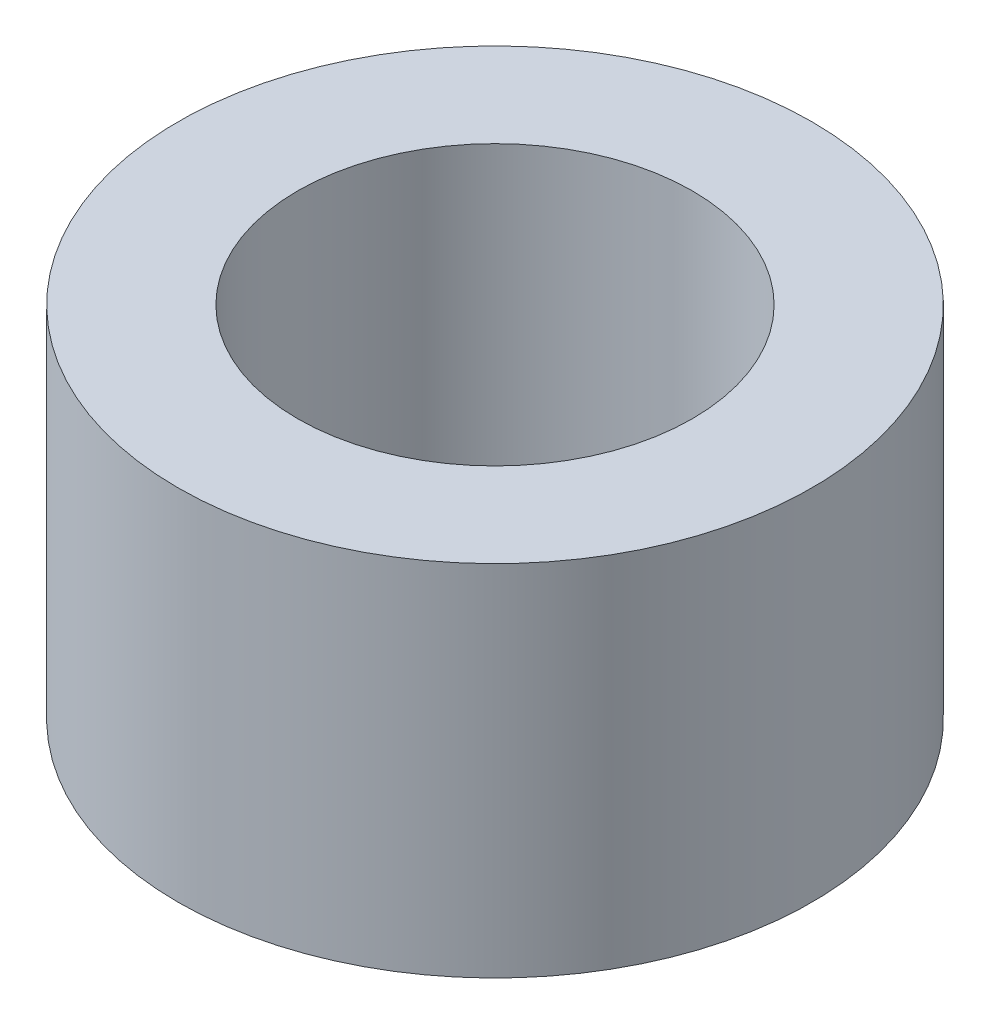
ISO-10303-21;
HEADER;
FILE_DESCRIPTION(('STEP AP214'),'2;1');
FILE_NAME('part.step','',(''),(''),'','','');
FILE_SCHEMA(('AUTOMOTIVE_DESIGN { 1 0 10303 214 1 1 1 1 }'));
ENDSEC;
DATA;
#1=APPLICATION_CONTEXT('core data for automotive mechanical design processes');
#2=APPLICATION_PROTOCOL_DEFINITION('international standard','automotive_design',2000,#1);
#3=PRODUCT_CONTEXT('',#1,'mechanical');
#4=PRODUCT('Part','Part','',(#3));
#5=PRODUCT_RELATED_PRODUCT_CATEGORY('part','',(#4));
#6=PRODUCT_DEFINITION_FORMATION('','',#4);
#7=PRODUCT_DEFINITION_CONTEXT('part definition',#1,'design');
#8=PRODUCT_DEFINITION('design','',#6,#7);
#9=PRODUCT_DEFINITION_SHAPE('','',#8);
#10=(LENGTH_UNIT() NAMED_UNIT(*) SI_UNIT(.MILLI.,.METRE.));
#11=(NAMED_UNIT(*) PLANE_ANGLE_UNIT() SI_UNIT($,.RADIAN.));
#12=(NAMED_UNIT(*) SI_UNIT($,.STERADIAN.) SOLID_ANGLE_UNIT());
#13=UNCERTAINTY_MEASURE_WITH_UNIT(LENGTH_MEASURE(1.E-05),#10,'distance_accuracy_value','');
#14=(GEOMETRIC_REPRESENTATION_CONTEXT(3) GLOBAL_UNCERTAINTY_ASSIGNED_CONTEXT((#13)) GLOBAL_UNIT_ASSIGNED_CONTEXT((#10,
#11,#12)) REPRESENTATION_CONTEXT('',''));
#15=CARTESIAN_POINT('',(0.,0.,0.));
#16=DIRECTION('',(0.,0.,1.));
#17=DIRECTION('',(1.,0.,0.));
#18=AXIS2_PLACEMENT_3D('',#15,#16,#17);
#19=CARTESIAN_POINT('',(0.,6.,0.));
#20=DIRECTION('',(0.,1.,0.));
#21=DIRECTION('',(0.,0.,1.));
#22=AXIS2_PLACEMENT_3D('',#19,#20,#21);
#23=PLANE('',#22);
#24=CARTESIAN_POINT('',(0.,6.,0.));
#25=DIRECTION('',(0.,1.,0.));
#26=DIRECTION('',(0.,0.,1.));
#27=AXIS2_PLACEMENT_3D('',#24,#25,#26);
#28=CIRCLE('',#27,5.3);
#29=CARTESIAN_POINT('',(0.,6.,5.3));
#30=VERTEX_POINT('',#29);
#31=EDGE_CURVE('E10',#30,#30,#28,.T.);
#32=ORIENTED_EDGE('',*,*,#31,.T.);
#33=EDGE_LOOP('',(#32));
#34=FACE_BOUND('',#33,.T.);
#35=CARTESIAN_POINT('',(0.,6.,0.));
#36=DIRECTION('',(0.,1.,0.));
#37=DIRECTION('',(0.,0.,1.));
#38=AXIS2_PLACEMENT_3D('',#35,#36,#37);
#39=CIRCLE('',#38,3.3);
#40=CARTESIAN_POINT('',(0.,6.,3.3));
#41=VERTEX_POINT('',#40);
#42=EDGE_CURVE('E48',#41,#41,#39,.T.);
#43=ORIENTED_EDGE('',*,*,#42,.F.);
#44=EDGE_LOOP('',(#43));
#45=FACE_BOUND('',#44,.T.);
#46=ADVANCED_FACE('F37',(#34,#45),#23,.T.);
#47=CARTESIAN_POINT('',(0.,0.,0.));
#48=DIRECTION('',(0.,1.,0.));
#49=DIRECTION('',(0.,0.,1.));
#50=AXIS2_PLACEMENT_3D('',#47,#48,#49);
#51=PLANE('',#50);
#52=CARTESIAN_POINT('',(0.,0.,0.));
#53=DIRECTION('',(0.,1.,0.));
#54=DIRECTION('',(0.,0.,1.));
#55=AXIS2_PLACEMENT_3D('',#52,#53,#54);
#56=CIRCLE('',#55,5.3);
#57=CARTESIAN_POINT('',(0.,0.,5.3));
#58=VERTEX_POINT('',#57);
#59=EDGE_CURVE('E41',#58,#58,#56,.T.);
#60=ORIENTED_EDGE('',*,*,#59,.F.);
#61=EDGE_LOOP('',(#60));
#62=FACE_BOUND('',#61,.T.);
#63=CARTESIAN_POINT('',(0.,0.,0.));
#64=DIRECTION('',(0.,1.,0.));
#65=DIRECTION('',(0.,0.,1.));
#66=AXIS2_PLACEMENT_3D('',#63,#64,#65);
#67=CIRCLE('',#66,3.3);
#68=CARTESIAN_POINT('',(0.,0.,3.3));
#69=VERTEX_POINT('',#68);
#70=EDGE_CURVE('E50',#69,#69,#67,.T.);
#71=ORIENTED_EDGE('',*,*,#70,.T.);
#72=EDGE_LOOP('',(#71));
#73=FACE_BOUND('',#72,.T.);
#74=ADVANCED_FACE('F60',(#62,#73),#51,.F.);
#75=CARTESIAN_POINT('',(0.,6.,0.));
#76=DIRECTION('',(0.,-1.,0.));
#77=DIRECTION('',(0.,0.,-1.));
#78=AXIS2_PLACEMENT_3D('',#75,#76,#77);
#79=CYLINDRICAL_SURFACE('',#78,5.3);
#80=ORIENTED_EDGE('',*,*,#31,.F.);
#81=EDGE_LOOP('',(#80));
#82=FACE_BOUND('',#81,.T.);
#83=ORIENTED_EDGE('',*,*,#59,.T.);
#84=EDGE_LOOP('',(#83));
#85=FACE_BOUND('',#84,.T.);
#86=ADVANCED_FACE('F39',(#82,#85),#79,.T.);
#87=CARTESIAN_POINT('',(0.,6.,0.));
#88=DIRECTION('',(0.,-1.,0.));
#89=DIRECTION('',(0.,0.,-1.));
#90=AXIS2_PLACEMENT_3D('',#87,#88,#89);
#91=CYLINDRICAL_SURFACE('',#90,3.3);
#92=ORIENTED_EDGE('',*,*,#42,.T.);
#93=EDGE_LOOP('',(#92));
#94=FACE_BOUND('',#93,.T.);
#95=ORIENTED_EDGE('',*,*,#70,.F.);
#96=EDGE_LOOP('',(#95));
#97=FACE_BOUND('',#96,.T.);
#98=ADVANCED_FACE('F56',(#94,#97),#91,.F.);
#99=CLOSED_SHELL('',(#46,#74,#86,#98));
#100=MANIFOLD_SOLID_BREP('B2',#99);
#101=ADVANCED_BREP_SHAPE_REPRESENTATION('',(#18,#100),#14);
#102=SHAPE_DEFINITION_REPRESENTATION(#9,#101);
ENDSEC;
END-ISO-10303-21;
